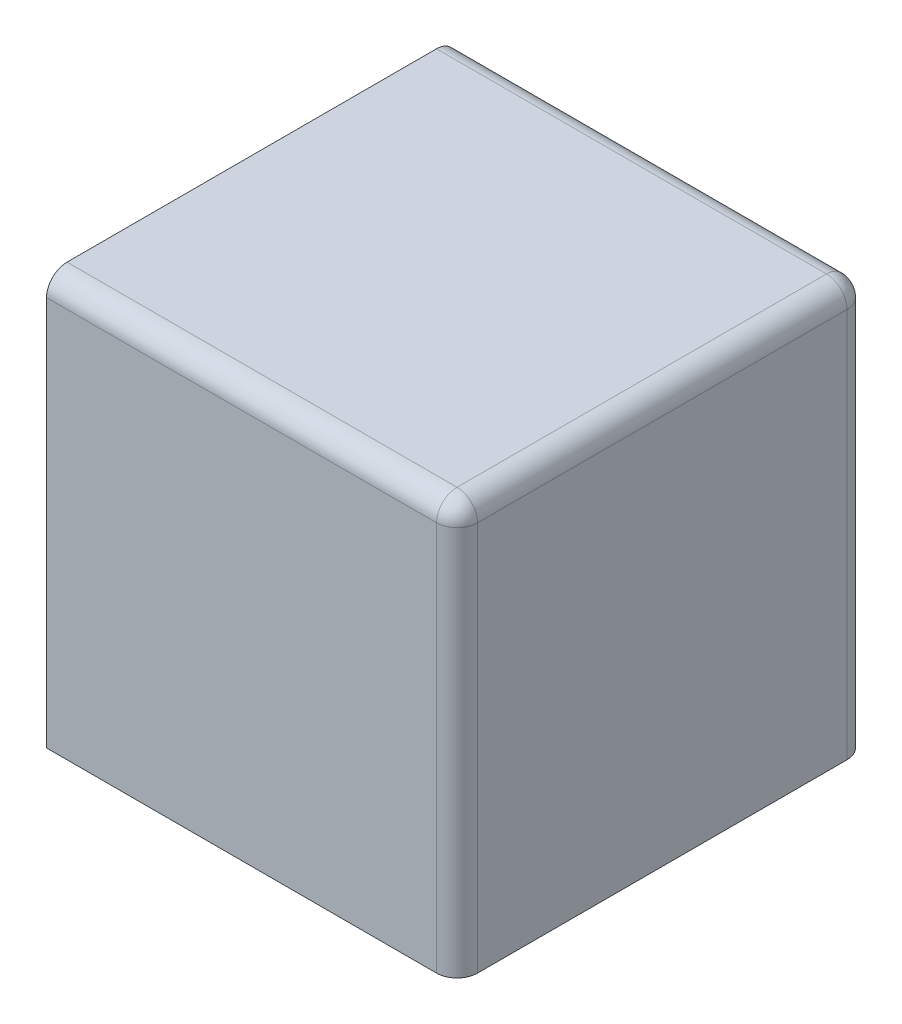
ISO-10303-21;
HEADER;
FILE_DESCRIPTION(('STEP AP214'),'2;1');
FILE_NAME('part.step','',(''),(''),'','','');
FILE_SCHEMA(('AUTOMOTIVE_DESIGN { 1 0 10303 214 1 1 1 1 }'));
ENDSEC;
DATA;
#1=APPLICATION_CONTEXT('core data for automotive mechanical design processes');
#2=APPLICATION_PROTOCOL_DEFINITION('international standard','automotive_design',2000,#1);
#3=PRODUCT_CONTEXT('',#1,'mechanical');
#4=PRODUCT('Part','Part','',(#3));
#5=PRODUCT_RELATED_PRODUCT_CATEGORY('part','',(#4));
#6=PRODUCT_DEFINITION_FORMATION('','',#4);
#7=PRODUCT_DEFINITION_CONTEXT('part definition',#1,'design');
#8=PRODUCT_DEFINITION('design','',#6,#7);
#9=PRODUCT_DEFINITION_SHAPE('','',#8);
#10=(LENGTH_UNIT() NAMED_UNIT(*) SI_UNIT(.MILLI.,.METRE.));
#11=(NAMED_UNIT(*) PLANE_ANGLE_UNIT() SI_UNIT($,.RADIAN.));
#12=(NAMED_UNIT(*) SI_UNIT($,.STERADIAN.) SOLID_ANGLE_UNIT());
#13=UNCERTAINTY_MEASURE_WITH_UNIT(LENGTH_MEASURE(1.E-05),#10,'distance_accuracy_value','');
#14=(GEOMETRIC_REPRESENTATION_CONTEXT(3) GLOBAL_UNCERTAINTY_ASSIGNED_CONTEXT((#13)) GLOBAL_UNIT_ASSIGNED_CONTEXT((#10,
#11,#12)) REPRESENTATION_CONTEXT('',''));
#15=CARTESIAN_POINT('',(0.,0.,0.));
#16=DIRECTION('',(0.,0.,1.));
#17=DIRECTION('',(1.,0.,0.));
#18=AXIS2_PLACEMENT_3D('',#15,#16,#17);
#19=CARTESIAN_POINT('',(-10.,20.,-10.));
#20=DIRECTION('',(1.,0.,0.));
#21=DIRECTION('',(0.,0.,-1.));
#22=AXIS2_PLACEMENT_3D('',#19,#20,#21);
#23=PLANE('',#22);
#24=CARTESIAN_POINT('',(-10.,10.,0.));
#25=DIRECTION('',(-1.,0.,0.));
#26=DIRECTION('',(0.,0.,1.));
#27=AXIS2_PLACEMENT_3D('',#24,#25,#26);
#28=CIRCLE('',#27,2.5);
#29=CARTESIAN_POINT('',(-10.,10.,2.5));
#30=VERTEX_POINT('',#29);
#31=EDGE_CURVE('E116',#30,#30,#28,.T.);
#32=ORIENTED_EDGE('',*,*,#31,.F.);
#33=EDGE_LOOP('',(#32));
#34=FACE_BOUND('',#33,.T.);
#35=DIRECTION('',(0.,-1.,0.));
#36=VECTOR('',#35,1.);
#37=CARTESIAN_POINT('',(-10.,20.,10.));
#38=LINE('',#37,#36);
#39=CARTESIAN_POINT('',(-10.,19.,10.));
#40=VERTEX_POINT('',#39);
#41=CARTESIAN_POINT('',(-10.,0.,10.));
#42=VERTEX_POINT('',#41);
#43=EDGE_CURVE('E107',#40,#42,#38,.T.);
#44=ORIENTED_EDGE('',*,*,#43,.F.);
#45=CARTESIAN_POINT('',(-10.,19.,9.));
#46=DIRECTION('',(1.,0.,0.));
#47=DIRECTION('',(0.,0.,-1.));
#48=AXIS2_PLACEMENT_3D('',#45,#46,#47);
#49=CIRCLE('',#48,1.);
#50=CARTESIAN_POINT('',(-10.,20.,9.));
#51=VERTEX_POINT('',#50);
#52=EDGE_CURVE('E162',#40,#51,#49,.F.);
#53=ORIENTED_EDGE('',*,*,#52,.T.);
#54=DIRECTION('',(0.,0.,1.));
#55=VECTOR('',#54,1.);
#56=CARTESIAN_POINT('',(-10.,20.,-10.));
#57=LINE('',#56,#55);
#58=CARTESIAN_POINT('',(-10.,20.,-9.));
#59=VERTEX_POINT('',#58);
#60=EDGE_CURVE('E134',#59,#51,#57,.T.);
#61=ORIENTED_EDGE('',*,*,#60,.F.);
#62=CARTESIAN_POINT('',(-10.,19.,-9.));
#63=DIRECTION('',(1.,0.,0.));
#64=DIRECTION('',(0.,0.,-1.));
#65=AXIS2_PLACEMENT_3D('',#62,#63,#64);
#66=CIRCLE('',#65,1.);
#67=CARTESIAN_POINT('',(-10.,19.,-10.));
#68=VERTEX_POINT('',#67);
#69=EDGE_CURVE('E64',#59,#68,#66,.F.);
#70=ORIENTED_EDGE('',*,*,#69,.T.);
#71=DIRECTION('',(0.,-1.,0.));
#72=VECTOR('',#71,1.);
#73=CARTESIAN_POINT('',(-10.,20.,-10.));
#74=LINE('',#73,#72);
#75=CARTESIAN_POINT('',(-10.,0.,-10.));
#76=VERTEX_POINT('',#75);
#77=EDGE_CURVE('E117',#68,#76,#74,.T.);
#78=ORIENTED_EDGE('',*,*,#77,.T.);
#79=DIRECTION('',(0.,0.,1.));
#80=VECTOR('',#79,1.);
#81=CARTESIAN_POINT('',(-10.,0.,-10.));
#82=LINE('',#81,#80);
#83=EDGE_CURVE('E124',#76,#42,#82,.T.);
#84=ORIENTED_EDGE('',*,*,#83,.T.);
#85=EDGE_LOOP('',(#44,#53,#61,#70,#78,#84));
#86=FACE_BOUND('',#85,.T.);
#87=ADVANCED_FACE('F41',(#34,#86),#23,.F.);
#88=CARTESIAN_POINT('',(10.,20.,10.));
#89=DIRECTION('',(0.,0.,-1.));
#90=DIRECTION('',(-1.,0.,0.));
#91=AXIS2_PLACEMENT_3D('',#88,#89,#90);
#92=PLANE('',#91);
#93=DIRECTION('',(1.,0.,0.));
#94=VECTOR('',#93,1.);
#95=CARTESIAN_POINT('',(10.,0.,10.));
#96=LINE('',#95,#94);
#97=CARTESIAN_POINT('',(9.,0.,10.));
#98=VERTEX_POINT('',#97);
#99=EDGE_CURVE('E110',#42,#98,#96,.T.);
#100=ORIENTED_EDGE('',*,*,#99,.T.);
#101=DIRECTION('',(0.,-1.,0.));
#102=VECTOR('',#101,1.);
#103=CARTESIAN_POINT('',(9.,20.,10.));
#104=LINE('',#103,#102);
#105=CARTESIAN_POINT('',(9.,19.,10.));
#106=VERTEX_POINT('',#105);
#107=EDGE_CURVE('E153',#98,#106,#104,.F.);
#108=ORIENTED_EDGE('',*,*,#107,.T.);
#109=DIRECTION('',(1.,0.,0.));
#110=VECTOR('',#109,1.);
#111=CARTESIAN_POINT('',(10.,19.,10.));
#112=LINE('',#111,#110);
#113=EDGE_CURVE('E113',#106,#40,#112,.F.);
#114=ORIENTED_EDGE('',*,*,#113,.T.);
#115=ORIENTED_EDGE('',*,*,#43,.T.);
#116=EDGE_LOOP('',(#100,#108,#114,#115));
#117=FACE_BOUND('',#116,.T.);
#118=ADVANCED_FACE('F109',(#117),#92,.F.);
#119=CARTESIAN_POINT('',(10.,20.,-10.));
#120=DIRECTION('',(-1.,0.,0.));
#121=DIRECTION('',(0.,0.,1.));
#122=AXIS2_PLACEMENT_3D('',#119,#120,#121);
#123=PLANE('',#122);
#124=DIRECTION('',(0.,0.,-1.));
#125=VECTOR('',#124,1.);
#126=CARTESIAN_POINT('',(10.,19.,-10.));
#127=LINE('',#126,#125);
#128=CARTESIAN_POINT('',(10.,19.,-9.));
#129=VERTEX_POINT('',#128);
#130=CARTESIAN_POINT('',(10.,19.,9.));
#131=VERTEX_POINT('',#130);
#132=EDGE_CURVE('E142',#129,#131,#127,.F.);
#133=ORIENTED_EDGE('',*,*,#132,.T.);
#134=DIRECTION('',(0.,-1.,0.));
#135=VECTOR('',#134,1.);
#136=CARTESIAN_POINT('',(10.,20.,9.));
#137=LINE('',#136,#135);
#138=CARTESIAN_POINT('',(10.,0.,9.));
#139=VERTEX_POINT('',#138);
#140=EDGE_CURVE('E146',#131,#139,#137,.T.);
#141=ORIENTED_EDGE('',*,*,#140,.T.);
#142=DIRECTION('',(0.,0.,-1.));
#143=VECTOR('',#142,1.);
#144=CARTESIAN_POINT('',(10.,0.,-10.));
#145=LINE('',#144,#143);
#146=CARTESIAN_POINT('',(10.,0.,-9.));
#147=VERTEX_POINT('',#146);
#148=EDGE_CURVE('E126',#139,#147,#145,.T.);
#149=ORIENTED_EDGE('',*,*,#148,.T.);
#150=DIRECTION('',(0.,-1.,0.));
#151=VECTOR('',#150,1.);
#152=CARTESIAN_POINT('',(10.,20.,-9.));
#153=LINE('',#152,#151);
#154=EDGE_CURVE('E144',#147,#129,#153,.F.);
#155=ORIENTED_EDGE('',*,*,#154,.T.);
#156=EDGE_LOOP('',(#133,#141,#149,#155));
#157=FACE_BOUND('',#156,.T.);
#158=ADVANCED_FACE('F194',(#157),#123,.F.);
#159=CARTESIAN_POINT('',(10.,20.,-10.));
#160=DIRECTION('',(0.,0.,1.));
#161=DIRECTION('',(1.,0.,0.));
#162=AXIS2_PLACEMENT_3D('',#159,#160,#161);
#163=PLANE('',#162);
#164=DIRECTION('',(-1.,0.,0.));
#165=VECTOR('',#164,1.);
#166=CARTESIAN_POINT('',(10.,19.,-10.));
#167=LINE('',#166,#165);
#168=CARTESIAN_POINT('',(9.,19.,-10.));
#169=VERTEX_POINT('',#168);
#170=EDGE_CURVE('E50',#68,#169,#167,.F.);
#171=ORIENTED_EDGE('',*,*,#170,.T.);
#172=DIRECTION('',(0.,-1.,0.));
#173=VECTOR('',#172,1.);
#174=CARTESIAN_POINT('',(9.,20.,-10.));
#175=LINE('',#174,#173);
#176=CARTESIAN_POINT('',(9.,0.,-10.));
#177=VERTEX_POINT('',#176);
#178=EDGE_CURVE('E11',#169,#177,#175,.T.);
#179=ORIENTED_EDGE('',*,*,#178,.T.);
#180=DIRECTION('',(-1.,0.,0.));
#181=VECTOR('',#180,1.);
#182=CARTESIAN_POINT('',(10.,0.,-10.));
#183=LINE('',#182,#181);
#184=EDGE_CURVE('E139',#177,#76,#183,.T.);
#185=ORIENTED_EDGE('',*,*,#184,.T.);
#186=ORIENTED_EDGE('',*,*,#77,.F.);
#187=EDGE_LOOP('',(#171,#179,#185,#186));
#188=FACE_BOUND('',#187,.T.);
#189=ADVANCED_FACE('F200',(#188),#163,.F.);
#190=CARTESIAN_POINT('',(0.,20.,0.));
#191=DIRECTION('',(0.,-1.,0.));
#192=DIRECTION('',(0.,0.,-1.));
#193=AXIS2_PLACEMENT_3D('',#190,#191,#192);
#194=PLANE('',#193);
#195=ORIENTED_EDGE('',*,*,#60,.T.);
#196=DIRECTION('',(1.,0.,0.));
#197=VECTOR('',#196,1.);
#198=CARTESIAN_POINT('',(0.,20.,9.));
#199=LINE('',#198,#197);
#200=CARTESIAN_POINT('',(9.,20.,9.));
#201=VERTEX_POINT('',#200);
#202=EDGE_CURVE('E159',#51,#201,#199,.T.);
#203=ORIENTED_EDGE('',*,*,#202,.T.);
#204=DIRECTION('',(0.,0.,-1.));
#205=VECTOR('',#204,1.);
#206=CARTESIAN_POINT('',(9.,20.,0.));
#207=LINE('',#206,#205);
#208=CARTESIAN_POINT('',(9.,20.,-9.));
#209=VERTEX_POINT('',#208);
#210=EDGE_CURVE('E157',#201,#209,#207,.T.);
#211=ORIENTED_EDGE('',*,*,#210,.T.);
#212=DIRECTION('',(-1.,0.,0.));
#213=VECTOR('',#212,1.);
#214=CARTESIAN_POINT('',(0.,20.,-9.));
#215=LINE('',#214,#213);
#216=EDGE_CURVE('E155',#209,#59,#215,.T.);
#217=ORIENTED_EDGE('',*,*,#216,.T.);
#218=EDGE_LOOP('',(#195,#203,#211,#217));
#219=FACE_BOUND('',#218,.T.);
#220=ADVANCED_FACE('F203',(#219),#194,.F.);
#221=CARTESIAN_POINT('',(0.,0.,0.));
#222=DIRECTION('',(0.,-1.,0.));
#223=DIRECTION('',(0.,0.,-1.));
#224=AXIS2_PLACEMENT_3D('',#221,#222,#223);
#225=PLANE('',#224);
#226=ORIENTED_EDGE('',*,*,#148,.F.);
#227=CARTESIAN_POINT('',(9.,0.,9.));
#228=DIRECTION('',(0.,-1.,0.));
#229=DIRECTION('',(0.,0.,-1.));
#230=AXIS2_PLACEMENT_3D('',#227,#228,#229);
#231=CIRCLE('',#230,1.);
#232=EDGE_CURVE('E125',#139,#98,#231,.T.);
#233=ORIENTED_EDGE('',*,*,#232,.T.);
#234=ORIENTED_EDGE('',*,*,#99,.F.);
#235=ORIENTED_EDGE('',*,*,#83,.F.);
#236=ORIENTED_EDGE('',*,*,#184,.F.);
#237=CARTESIAN_POINT('',(9.,0.,-9.));
#238=DIRECTION('',(0.,-1.,0.));
#239=DIRECTION('',(0.,0.,-1.));
#240=AXIS2_PLACEMENT_3D('',#237,#238,#239);
#241=CIRCLE('',#240,1.);
#242=EDGE_CURVE('E149',#177,#147,#241,.T.);
#243=ORIENTED_EDGE('',*,*,#242,.T.);
#244=EDGE_LOOP('',(#226,#233,#234,#235,#236,#243));
#245=FACE_BOUND('',#244,.T.);
#246=ADVANCED_FACE('F122',(#245),#225,.T.);
#247=CARTESIAN_POINT('',(-16.,10.,0.));
#248=DIRECTION('',(1.,0.,0.));
#249=DIRECTION('',(0.,0.,-1.));
#250=AXIS2_PLACEMENT_3D('',#247,#248,#249);
#251=CYLINDRICAL_SURFACE('',#250,2.5);
#252=CARTESIAN_POINT('',(-16.,10.,0.));
#253=DIRECTION('',(-1.,0.,0.));
#254=DIRECTION('',(0.,0.,1.));
#255=AXIS2_PLACEMENT_3D('',#252,#253,#254);
#256=CIRCLE('',#255,2.5);
#257=CARTESIAN_POINT('',(-16.,10.,2.5));
#258=VERTEX_POINT('',#257);
#259=EDGE_CURVE('E129',#258,#258,#256,.T.);
#260=ORIENTED_EDGE('',*,*,#259,.F.);
#261=EDGE_LOOP('',(#260));
#262=FACE_BOUND('',#261,.T.);
#263=ORIENTED_EDGE('',*,*,#31,.T.);
#264=EDGE_LOOP('',(#263));
#265=FACE_BOUND('',#264,.T.);
#266=ADVANCED_FACE('F232',(#262,#265),#251,.T.);
#267=CARTESIAN_POINT('',(-16.,10.,0.));
#268=DIRECTION('',(-1.,0.,0.));
#269=DIRECTION('',(0.,0.,1.));
#270=AXIS2_PLACEMENT_3D('',#267,#268,#269);
#271=PLANE('',#270);
#272=ORIENTED_EDGE('',*,*,#259,.T.);
#273=EDGE_LOOP('',(#272));
#274=FACE_BOUND('',#273,.T.);
#275=ADVANCED_FACE('F237',(#274),#271,.T.);
#276=CARTESIAN_POINT('',(0.,19.,-9.));
#277=DIRECTION('',(-1.,0.,0.));
#278=DIRECTION('',(0.,0.,1.));
#279=AXIS2_PLACEMENT_3D('',#276,#277,#278);
#280=CYLINDRICAL_SURFACE('',#279,1.);
#281=ORIENTED_EDGE('',*,*,#69,.F.);
#282=ORIENTED_EDGE('',*,*,#216,.F.);
#283=CARTESIAN_POINT('',(9.,19.,-9.));
#284=DIRECTION('',(1.,0.,0.));
#285=DIRECTION('',(0.,0.,-1.));
#286=AXIS2_PLACEMENT_3D('',#283,#284,#285);
#287=CIRCLE('',#286,1.);
#288=EDGE_CURVE('E45',#169,#209,#287,.T.);
#289=ORIENTED_EDGE('',*,*,#288,.F.);
#290=ORIENTED_EDGE('',*,*,#170,.F.);
#291=EDGE_LOOP('',(#281,#282,#289,#290));
#292=FACE_BOUND('',#291,.T.);
#293=ADVANCED_FACE('F43',(#292),#280,.T.);
#294=CARTESIAN_POINT('',(9.,20.,-9.));
#295=DIRECTION('',(0.,-1.,0.));
#296=DIRECTION('',(0.,0.,-1.));
#297=AXIS2_PLACEMENT_3D('',#294,#295,#296);
#298=CYLINDRICAL_SURFACE('',#297,1.);
#299=ORIENTED_EDGE('',*,*,#242,.F.);
#300=ORIENTED_EDGE('',*,*,#178,.F.);
#301=CARTESIAN_POINT('',(9.,19.,-9.));
#302=DIRECTION('',(0.,1.,0.));
#303=DIRECTION('',(0.,0.,1.));
#304=AXIS2_PLACEMENT_3D('',#301,#302,#303);
#305=CIRCLE('',#304,1.);
#306=EDGE_CURVE('E176',#129,#169,#305,.T.);
#307=ORIENTED_EDGE('',*,*,#306,.F.);
#308=ORIENTED_EDGE('',*,*,#154,.F.);
#309=EDGE_LOOP('',(#299,#300,#307,#308));
#310=FACE_BOUND('',#309,.T.);
#311=ADVANCED_FACE('F199',(#310),#298,.T.);
#312=CARTESIAN_POINT('',(9.,19.,-9.));
#313=DIRECTION('',(0.,0.,-1.));
#314=DIRECTION('',(-1.,0.,0.));
#315=AXIS2_PLACEMENT_3D('',#312,#313,#314);
#316=SPHERICAL_SURFACE('',#315,1.);
#317=ORIENTED_EDGE('',*,*,#306,.T.);
#318=ORIENTED_EDGE('',*,*,#288,.T.);
#319=CARTESIAN_POINT('',(9.,19.,-9.));
#320=DIRECTION('',(0.,0.,-1.));
#321=DIRECTION('',(-1.,0.,0.));
#322=AXIS2_PLACEMENT_3D('',#319,#320,#321);
#323=CIRCLE('',#322,1.);
#324=EDGE_CURVE('E174',#129,#209,#323,.F.);
#325=ORIENTED_EDGE('',*,*,#324,.F.);
#326=EDGE_LOOP('',(#317,#318,#325));
#327=FACE_BOUND('',#326,.T.);
#328=ADVANCED_FACE('F183',(#327),#316,.T.);
#329=CARTESIAN_POINT('',(0.,19.,9.));
#330=DIRECTION('',(1.,0.,0.));
#331=DIRECTION('',(0.,0.,-1.));
#332=AXIS2_PLACEMENT_3D('',#329,#330,#331);
#333=CYLINDRICAL_SURFACE('',#332,1.);
#334=ORIENTED_EDGE('',*,*,#52,.F.);
#335=ORIENTED_EDGE('',*,*,#113,.F.);
#336=CARTESIAN_POINT('',(9.,19.,9.));
#337=DIRECTION('',(1.,0.,0.));
#338=DIRECTION('',(0.,0.,-1.));
#339=AXIS2_PLACEMENT_3D('',#336,#337,#338);
#340=CIRCLE('',#339,1.);
#341=EDGE_CURVE('E171',#201,#106,#340,.T.);
#342=ORIENTED_EDGE('',*,*,#341,.F.);
#343=ORIENTED_EDGE('',*,*,#202,.F.);
#344=EDGE_LOOP('',(#334,#335,#342,#343));
#345=FACE_BOUND('',#344,.T.);
#346=ADVANCED_FACE('F206',(#345),#333,.T.);
#347=CARTESIAN_POINT('',(9.,19.,0.));
#348=DIRECTION('',(0.,0.,-1.));
#349=DIRECTION('',(-1.,0.,0.));
#350=AXIS2_PLACEMENT_3D('',#347,#348,#349);
#351=CYLINDRICAL_SURFACE('',#350,1.);
#352=ORIENTED_EDGE('',*,*,#324,.T.);
#353=ORIENTED_EDGE('',*,*,#210,.F.);
#354=CARTESIAN_POINT('',(9.,19.,9.));
#355=DIRECTION('',(0.,0.,1.));
#356=DIRECTION('',(1.,0.,0.));
#357=AXIS2_PLACEMENT_3D('',#354,#355,#356);
#358=CIRCLE('',#357,1.);
#359=EDGE_CURVE('E168',#131,#201,#358,.T.);
#360=ORIENTED_EDGE('',*,*,#359,.F.);
#361=ORIENTED_EDGE('',*,*,#132,.F.);
#362=EDGE_LOOP('',(#352,#353,#360,#361));
#363=FACE_BOUND('',#362,.T.);
#364=ADVANCED_FACE('F189',(#363),#351,.T.);
#365=CARTESIAN_POINT('',(9.,19.,9.));
#366=DIRECTION('',(0.,1.,0.));
#367=DIRECTION('',(0.,0.,1.));
#368=AXIS2_PLACEMENT_3D('',#365,#366,#367);
#369=SPHERICAL_SURFACE('',#368,1.);
#370=ORIENTED_EDGE('',*,*,#359,.T.);
#371=ORIENTED_EDGE('',*,*,#341,.T.);
#372=CARTESIAN_POINT('',(9.,19.,9.));
#373=DIRECTION('',(0.,1.,0.));
#374=DIRECTION('',(0.,0.,1.));
#375=AXIS2_PLACEMENT_3D('',#372,#373,#374);
#376=CIRCLE('',#375,1.);
#377=EDGE_CURVE('E165',#131,#106,#376,.F.);
#378=ORIENTED_EDGE('',*,*,#377,.F.);
#379=EDGE_LOOP('',(#370,#371,#378));
#380=FACE_BOUND('',#379,.T.);
#381=ADVANCED_FACE('F208',(#380),#369,.T.);
#382=CARTESIAN_POINT('',(9.,20.,9.));
#383=DIRECTION('',(0.,-1.,0.));
#384=DIRECTION('',(0.,0.,-1.));
#385=AXIS2_PLACEMENT_3D('',#382,#383,#384);
#386=CYLINDRICAL_SURFACE('',#385,1.);
#387=ORIENTED_EDGE('',*,*,#377,.T.);
#388=ORIENTED_EDGE('',*,*,#107,.F.);
#389=ORIENTED_EDGE('',*,*,#232,.F.);
#390=ORIENTED_EDGE('',*,*,#140,.F.);
#391=EDGE_LOOP('',(#387,#388,#389,#390));
#392=FACE_BOUND('',#391,.T.);
#393=ADVANCED_FACE('F210',(#392),#386,.T.);
#394=CLOSED_SHELL('',(#87,#118,#158,#189,#220,#246,#266,#275,#293,#311,#328,#346,#364,#381,#393));
#395=MANIFOLD_SOLID_BREP('B2',#394);
#396=ADVANCED_BREP_SHAPE_REPRESENTATION('',(#18,#395),#14);
#397=SHAPE_DEFINITION_REPRESENTATION(#9,#396);
ENDSEC;
END-ISO-10303-21;
